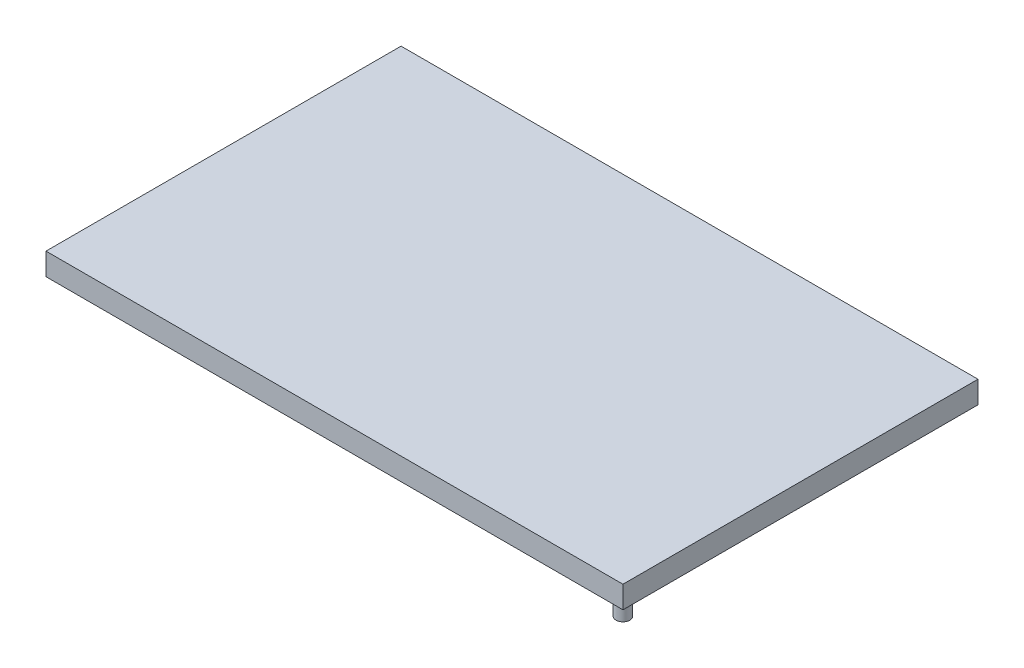
ISO-10303-21;
HEADER;
FILE_DESCRIPTION(('STEP AP214'),'2;1');
FILE_NAME('part.step','',(''),(''),'','','');
FILE_SCHEMA(('AUTOMOTIVE_DESIGN { 1 0 10303 214 1 1 1 1 }'));
ENDSEC;
DATA;
#1=APPLICATION_CONTEXT('core data for automotive mechanical design processes');
#2=APPLICATION_PROTOCOL_DEFINITION('international standard','automotive_design',2000,#1);
#3=PRODUCT_CONTEXT('',#1,'mechanical');
#4=PRODUCT('Part','Part','',(#3));
#5=PRODUCT_RELATED_PRODUCT_CATEGORY('part','',(#4));
#6=PRODUCT_DEFINITION_FORMATION('','',#4);
#7=PRODUCT_DEFINITION_CONTEXT('part definition',#1,'design');
#8=PRODUCT_DEFINITION('design','',#6,#7);
#9=PRODUCT_DEFINITION_SHAPE('','',#8);
#10=(LENGTH_UNIT() NAMED_UNIT(*) SI_UNIT(.MILLI.,.METRE.));
#11=(NAMED_UNIT(*) PLANE_ANGLE_UNIT() SI_UNIT($,.RADIAN.));
#12=(NAMED_UNIT(*) SI_UNIT($,.STERADIAN.) SOLID_ANGLE_UNIT());
#13=UNCERTAINTY_MEASURE_WITH_UNIT(LENGTH_MEASURE(1.E-05),#10,'distance_accuracy_value','');
#14=(GEOMETRIC_REPRESENTATION_CONTEXT(3) GLOBAL_UNCERTAINTY_ASSIGNED_CONTEXT((#13)) GLOBAL_UNIT_ASSIGNED_CONTEXT((#10,
#11,#12)) REPRESENTATION_CONTEXT('',''));
#15=CARTESIAN_POINT('',(0.,0.,0.));
#16=DIRECTION('',(0.,0.,1.));
#17=DIRECTION('',(1.,0.,0.));
#18=AXIS2_PLACEMENT_3D('',#15,#16,#17);
#19=CARTESIAN_POINT('',(-104.,8.,-64.));
#20=DIRECTION('',(0.,0.,-1.));
#21=DIRECTION('',(-1.,0.,0.));
#22=AXIS2_PLACEMENT_3D('',#19,#20,#21);
#23=PLANE('',#22);
#24=DIRECTION('',(1.,0.,0.));
#25=VECTOR('',#24,1.);
#26=CARTESIAN_POINT('',(-104.,0.,-64.));
#27=LINE('',#26,#25);
#28=CARTESIAN_POINT('',(-104.,0.,-64.));
#29=VERTEX_POINT('',#28);
#30=CARTESIAN_POINT('',(104.,0.,-64.));
#31=VERTEX_POINT('',#30);
#32=EDGE_CURVE('E112',#29,#31,#27,.T.);
#33=ORIENTED_EDGE('',*,*,#32,.F.);
#34=DIRECTION('',(0.,-1.,0.));
#35=VECTOR('',#34,1.);
#36=CARTESIAN_POINT('',(-104.,8.,-64.));
#37=LINE('',#36,#35);
#38=CARTESIAN_POINT('',(-104.,8.,-64.));
#39=VERTEX_POINT('',#38);
#40=EDGE_CURVE('E55',#39,#29,#37,.T.);
#41=ORIENTED_EDGE('',*,*,#40,.F.);
#42=DIRECTION('',(1.,0.,0.));
#43=VECTOR('',#42,1.);
#44=CARTESIAN_POINT('',(-104.,8.,-64.));
#45=LINE('',#44,#43);
#46=CARTESIAN_POINT('',(104.,8.,-64.));
#47=VERTEX_POINT('',#46);
#48=EDGE_CURVE('E144',#39,#47,#45,.T.);
#49=ORIENTED_EDGE('',*,*,#48,.T.);
#50=DIRECTION('',(0.,-1.,0.));
#51=VECTOR('',#50,1.);
#52=CARTESIAN_POINT('',(104.,8.,-64.));
#53=LINE('',#52,#51);
#54=EDGE_CURVE('E80',#47,#31,#53,.T.);
#55=ORIENTED_EDGE('',*,*,#54,.T.);
#56=EDGE_LOOP('',(#33,#41,#49,#55));
#57=FACE_BOUND('',#56,.T.);
#58=ADVANCED_FACE('F32',(#57),#23,.T.);
#59=CARTESIAN_POINT('',(-104.,8.,-64.));
#60=DIRECTION('',(1.,0.,0.));
#61=DIRECTION('',(0.,0.,-1.));
#62=AXIS2_PLACEMENT_3D('',#59,#60,#61);
#63=PLANE('',#62);
#64=DIRECTION('',(0.,0.,1.));
#65=VECTOR('',#64,1.);
#66=CARTESIAN_POINT('',(-104.,0.,-64.));
#67=LINE('',#66,#65);
#68=CARTESIAN_POINT('',(-104.,0.,64.));
#69=VERTEX_POINT('',#68);
#70=EDGE_CURVE('E147',#29,#69,#67,.T.);
#71=ORIENTED_EDGE('',*,*,#70,.T.);
#72=DIRECTION('',(0.,-1.,0.));
#73=VECTOR('',#72,1.);
#74=CARTESIAN_POINT('',(-104.,8.,64.));
#75=LINE('',#74,#73);
#76=CARTESIAN_POINT('',(-104.,8.,64.));
#77=VERTEX_POINT('',#76);
#78=EDGE_CURVE('E163',#77,#69,#75,.T.);
#79=ORIENTED_EDGE('',*,*,#78,.F.);
#80=DIRECTION('',(0.,0.,1.));
#81=VECTOR('',#80,1.);
#82=CARTESIAN_POINT('',(-104.,8.,-64.));
#83=LINE('',#82,#81);
#84=EDGE_CURVE('E151',#39,#77,#83,.T.);
#85=ORIENTED_EDGE('',*,*,#84,.F.);
#86=ORIENTED_EDGE('',*,*,#40,.T.);
#87=EDGE_LOOP('',(#71,#79,#85,#86));
#88=FACE_BOUND('',#87,.T.);
#89=ADVANCED_FACE('F189',(#88),#63,.F.);
#90=CARTESIAN_POINT('',(-104.,8.,64.));
#91=DIRECTION('',(0.,0.,-1.));
#92=DIRECTION('',(-1.,0.,0.));
#93=AXIS2_PLACEMENT_3D('',#90,#91,#92);
#94=PLANE('',#93);
#95=DIRECTION('',(1.,0.,0.));
#96=VECTOR('',#95,1.);
#97=CARTESIAN_POINT('',(-104.,0.,64.));
#98=LINE('',#97,#96);
#99=CARTESIAN_POINT('',(104.,0.,64.));
#100=VERTEX_POINT('',#99);
#101=EDGE_CURVE('E158',#69,#100,#98,.T.);
#102=ORIENTED_EDGE('',*,*,#101,.T.);
#103=DIRECTION('',(0.,-1.,0.));
#104=VECTOR('',#103,1.);
#105=CARTESIAN_POINT('',(104.,8.,64.));
#106=LINE('',#105,#104);
#107=CARTESIAN_POINT('',(104.,8.,64.));
#108=VERTEX_POINT('',#107);
#109=EDGE_CURVE('E166',#108,#100,#106,.T.);
#110=ORIENTED_EDGE('',*,*,#109,.F.);
#111=DIRECTION('',(1.,0.,0.));
#112=VECTOR('',#111,1.);
#113=CARTESIAN_POINT('',(-104.,8.,64.));
#114=LINE('',#113,#112);
#115=EDGE_CURVE('E149',#77,#108,#114,.T.);
#116=ORIENTED_EDGE('',*,*,#115,.F.);
#117=ORIENTED_EDGE('',*,*,#78,.T.);
#118=EDGE_LOOP('',(#102,#110,#116,#117));
#119=FACE_BOUND('',#118,.T.);
#120=ADVANCED_FACE('F193',(#119),#94,.F.);
#121=CARTESIAN_POINT('',(104.,8.,-64.));
#122=DIRECTION('',(1.,0.,0.));
#123=DIRECTION('',(0.,0.,-1.));
#124=AXIS2_PLACEMENT_3D('',#121,#122,#123);
#125=PLANE('',#124);
#126=DIRECTION('',(0.,0.,1.));
#127=VECTOR('',#126,1.);
#128=CARTESIAN_POINT('',(104.,0.,-64.));
#129=LINE('',#128,#127);
#130=EDGE_CURVE('E155',#31,#100,#129,.T.);
#131=ORIENTED_EDGE('',*,*,#130,.F.);
#132=ORIENTED_EDGE('',*,*,#54,.F.);
#133=DIRECTION('',(0.,0.,1.));
#134=VECTOR('',#133,1.);
#135=CARTESIAN_POINT('',(104.,8.,-64.));
#136=LINE('',#135,#134);
#137=EDGE_CURVE('E146',#47,#108,#136,.T.);
#138=ORIENTED_EDGE('',*,*,#137,.T.);
#139=ORIENTED_EDGE('',*,*,#109,.T.);
#140=EDGE_LOOP('',(#131,#132,#138,#139));
#141=FACE_BOUND('',#140,.T.);
#142=ADVANCED_FACE('F205',(#141),#125,.T.);
#143=CARTESIAN_POINT('',(0.,8.,0.));
#144=DIRECTION('',(0.,-1.,0.));
#145=DIRECTION('',(0.,0.,-1.));
#146=AXIS2_PLACEMENT_3D('',#143,#144,#145);
#147=PLANE('',#146);
#148=ORIENTED_EDGE('',*,*,#48,.F.);
#149=ORIENTED_EDGE('',*,*,#84,.T.);
#150=ORIENTED_EDGE('',*,*,#115,.T.);
#151=ORIENTED_EDGE('',*,*,#137,.F.);
#152=EDGE_LOOP('',(#148,#149,#150,#151));
#153=FACE_BOUND('',#152,.T.);
#154=ADVANCED_FACE('F204',(#153),#147,.F.);
#155=CARTESIAN_POINT('',(0.,0.,0.));
#156=DIRECTION('',(0.,-1.,0.));
#157=DIRECTION('',(0.,0.,-1.));
#158=AXIS2_PLACEMENT_3D('',#155,#156,#157);
#159=PLANE('',#158);
#160=DIRECTION('',(0.,0.,1.));
#161=VECTOR('',#160,1.);
#162=CARTESIAN_POINT('',(100.,0.,0.));
#163=LINE('',#162,#161);
#164=CARTESIAN_POINT('',(100.,0.,-60.));
#165=VERTEX_POINT('',#164);
#166=CARTESIAN_POINT('',(100.,0.,60.));
#167=VERTEX_POINT('',#166);
#168=EDGE_CURVE('E46',#165,#167,#163,.T.);
#169=ORIENTED_EDGE('',*,*,#168,.F.);
#170=DIRECTION('',(1.,0.,0.));
#171=VECTOR('',#170,1.);
#172=CARTESIAN_POINT('',(0.,0.,-60.));
#173=LINE('',#172,#171);
#174=CARTESIAN_POINT('',(-100.,0.,-60.));
#175=VERTEX_POINT('',#174);
#176=EDGE_CURVE('E111',#175,#165,#173,.T.);
#177=ORIENTED_EDGE('',*,*,#176,.F.);
#178=DIRECTION('',(0.,0.,1.));
#179=VECTOR('',#178,1.);
#180=CARTESIAN_POINT('',(-100.,0.,0.));
#181=LINE('',#180,#179);
#182=CARTESIAN_POINT('',(-100.,0.,60.));
#183=VERTEX_POINT('',#182);
#184=EDGE_CURVE('E135',#175,#183,#181,.T.);
#185=ORIENTED_EDGE('',*,*,#184,.T.);
#186=DIRECTION('',(1.,0.,0.));
#187=VECTOR('',#186,1.);
#188=CARTESIAN_POINT('',(0.,0.,60.));
#189=LINE('',#188,#187);
#190=EDGE_CURVE('E121',#183,#167,#189,.T.);
#191=ORIENTED_EDGE('',*,*,#190,.T.);
#192=EDGE_LOOP('',(#169,#177,#185,#191));
#193=FACE_BOUND('',#192,.T.);
#194=ORIENTED_EDGE('',*,*,#32,.T.);
#195=ORIENTED_EDGE('',*,*,#130,.T.);
#196=ORIENTED_EDGE('',*,*,#101,.F.);
#197=ORIENTED_EDGE('',*,*,#70,.F.);
#198=EDGE_LOOP('',(#194,#195,#196,#197));
#199=FACE_BOUND('',#198,.T.);
#200=ADVANCED_FACE('F196',(#193,#199),#159,.T.);
#201=CARTESIAN_POINT('',(100.,4.,0.));
#202=DIRECTION('',(1.,0.,0.));
#203=DIRECTION('',(0.,0.,-1.));
#204=AXIS2_PLACEMENT_3D('',#201,#202,#203);
#205=PLANE('',#204);
#206=ORIENTED_EDGE('',*,*,#168,.T.);
#207=DIRECTION('',(0.,-1.,0.));
#208=VECTOR('',#207,1.);
#209=CARTESIAN_POINT('',(100.,4.,60.));
#210=LINE('',#209,#208);
#211=CARTESIAN_POINT('',(100.,4.,60.));
#212=VERTEX_POINT('',#211);
#213=EDGE_CURVE('E118',#212,#167,#210,.T.);
#214=ORIENTED_EDGE('',*,*,#213,.F.);
#215=DIRECTION('',(0.,0.,1.));
#216=VECTOR('',#215,1.);
#217=CARTESIAN_POINT('',(100.,4.,0.));
#218=LINE('',#217,#216);
#219=CARTESIAN_POINT('',(100.,4.,-60.));
#220=VERTEX_POINT('',#219);
#221=EDGE_CURVE('E116',#220,#212,#218,.T.);
#222=ORIENTED_EDGE('',*,*,#221,.F.);
#223=DIRECTION('',(0.,-1.,0.));
#224=VECTOR('',#223,1.);
#225=CARTESIAN_POINT('',(100.,4.,-60.));
#226=LINE('',#225,#224);
#227=EDGE_CURVE('E105',#220,#165,#226,.T.);
#228=ORIENTED_EDGE('',*,*,#227,.T.);
#229=EDGE_LOOP('',(#206,#214,#222,#228));
#230=FACE_BOUND('',#229,.T.);
#231=ADVANCED_FACE('F117',(#230),#205,.F.);
#232=CARTESIAN_POINT('',(0.,4.,-60.));
#233=DIRECTION('',(0.,0.,-1.));
#234=DIRECTION('',(-1.,0.,0.));
#235=AXIS2_PLACEMENT_3D('',#232,#233,#234);
#236=PLANE('',#235);
#237=ORIENTED_EDGE('',*,*,#176,.T.);
#238=ORIENTED_EDGE('',*,*,#227,.F.);
#239=DIRECTION('',(1.,0.,0.));
#240=VECTOR('',#239,1.);
#241=CARTESIAN_POINT('',(0.,4.,-60.));
#242=LINE('',#241,#240);
#243=CARTESIAN_POINT('',(-100.,4.,-60.));
#244=VERTEX_POINT('',#243);
#245=EDGE_CURVE('E109',#244,#220,#242,.T.);
#246=ORIENTED_EDGE('',*,*,#245,.F.);
#247=DIRECTION('',(0.,-1.,0.));
#248=VECTOR('',#247,1.);
#249=CARTESIAN_POINT('',(-100.,4.,-60.));
#250=LINE('',#249,#248);
#251=EDGE_CURVE('E113',#244,#175,#250,.T.);
#252=ORIENTED_EDGE('',*,*,#251,.T.);
#253=EDGE_LOOP('',(#237,#238,#246,#252));
#254=FACE_BOUND('',#253,.T.);
#255=ADVANCED_FACE('F107',(#254),#236,.F.);
#256=CARTESIAN_POINT('',(-100.,4.,0.));
#257=DIRECTION('',(1.,0.,0.));
#258=DIRECTION('',(0.,0.,-1.));
#259=AXIS2_PLACEMENT_3D('',#256,#257,#258);
#260=PLANE('',#259);
#261=ORIENTED_EDGE('',*,*,#184,.F.);
#262=ORIENTED_EDGE('',*,*,#251,.F.);
#263=DIRECTION('',(0.,0.,1.));
#264=VECTOR('',#263,1.);
#265=CARTESIAN_POINT('',(-100.,4.,0.));
#266=LINE('',#265,#264);
#267=CARTESIAN_POINT('',(-100.,4.,60.));
#268=VERTEX_POINT('',#267);
#269=EDGE_CURVE('E125',#244,#268,#266,.T.);
#270=ORIENTED_EDGE('',*,*,#269,.T.);
#271=DIRECTION('',(0.,-1.,0.));
#272=VECTOR('',#271,1.);
#273=CARTESIAN_POINT('',(-100.,4.,60.));
#274=LINE('',#273,#272);
#275=EDGE_CURVE('E141',#268,#183,#274,.T.);
#276=ORIENTED_EDGE('',*,*,#275,.T.);
#277=EDGE_LOOP('',(#261,#262,#270,#276));
#278=FACE_BOUND('',#277,.T.);
#279=ADVANCED_FACE('F184',(#278),#260,.T.);
#280=CARTESIAN_POINT('',(0.,4.,60.));
#281=DIRECTION('',(0.,0.,-1.));
#282=DIRECTION('',(-1.,0.,0.));
#283=AXIS2_PLACEMENT_3D('',#280,#281,#282);
#284=PLANE('',#283);
#285=ORIENTED_EDGE('',*,*,#190,.F.);
#286=ORIENTED_EDGE('',*,*,#275,.F.);
#287=DIRECTION('',(1.,0.,0.));
#288=VECTOR('',#287,1.);
#289=CARTESIAN_POINT('',(0.,4.,60.));
#290=LINE('',#289,#288);
#291=EDGE_CURVE('E127',#268,#212,#290,.T.);
#292=ORIENTED_EDGE('',*,*,#291,.T.);
#293=ORIENTED_EDGE('',*,*,#213,.T.);
#294=EDGE_LOOP('',(#285,#286,#292,#293));
#295=FACE_BOUND('',#294,.T.);
#296=ADVANCED_FACE('F174',(#295),#284,.T.);
#297=CARTESIAN_POINT('',(0.,4.,0.));
#298=DIRECTION('',(0.,1.,0.));
#299=DIRECTION('',(0.,0.,1.));
#300=AXIS2_PLACEMENT_3D('',#297,#298,#299);
#301=PLANE('',#300);
#302=CARTESIAN_POINT('',(90.,4.,50.));
#303=DIRECTION('',(0.,1.,0.));
#304=DIRECTION('',(0.,0.,1.));
#305=AXIS2_PLACEMENT_3D('',#302,#303,#304);
#306=CIRCLE('',#305,2.50000000000001);
#307=CARTESIAN_POINT('',(90.,4.,52.5));
#308=VERTEX_POINT('',#307);
#309=EDGE_CURVE('E11',#308,#308,#306,.F.);
#310=ORIENTED_EDGE('',*,*,#309,.F.);
#311=EDGE_LOOP('',(#310));
#312=FACE_BOUND('',#311,.T.);
#313=CARTESIAN_POINT('',(-90.,4.,-50.));
#314=DIRECTION('',(0.,1.,0.));
#315=DIRECTION('',(0.,0.,1.));
#316=AXIS2_PLACEMENT_3D('',#313,#314,#315);
#317=CIRCLE('',#316,2.50000000000001);
#318=CARTESIAN_POINT('',(-90.,4.,-47.5));
#319=VERTEX_POINT('',#318);
#320=EDGE_CURVE('E39',#319,#319,#317,.F.);
#321=ORIENTED_EDGE('',*,*,#320,.F.);
#322=EDGE_LOOP('',(#321));
#323=FACE_BOUND('',#322,.T.);
#324=ORIENTED_EDGE('',*,*,#221,.T.);
#325=ORIENTED_EDGE('',*,*,#291,.F.);
#326=ORIENTED_EDGE('',*,*,#269,.F.);
#327=ORIENTED_EDGE('',*,*,#245,.T.);
#328=EDGE_LOOP('',(#324,#325,#326,#327));
#329=FACE_BOUND('',#328,.T.);
#330=ADVANCED_FACE('F124',(#312,#323,#329),#301,.F.);
#331=CARTESIAN_POINT('',(-90.,-16.,-50.));
#332=DIRECTION('',(0.,1.,0.));
#333=DIRECTION('',(0.,0.,1.));
#334=AXIS2_PLACEMENT_3D('',#331,#332,#333);
#335=CYLINDRICAL_SURFACE('',#334,2.50000000000001);
#336=CARTESIAN_POINT('',(-90.,-16.,-50.));
#337=DIRECTION('',(0.,-1.,0.));
#338=DIRECTION('',(0.,0.,-1.));
#339=AXIS2_PLACEMENT_3D('',#336,#337,#338);
#340=CIRCLE('',#339,2.50000000000001);
#341=CARTESIAN_POINT('',(-90.,-16.,-52.5));
#342=VERTEX_POINT('',#341);
#343=EDGE_CURVE('E133',#342,#342,#340,.T.);
#344=ORIENTED_EDGE('',*,*,#343,.F.);
#345=EDGE_LOOP('',(#344));
#346=FACE_BOUND('',#345,.T.);
#347=ORIENTED_EDGE('',*,*,#320,.T.);
#348=EDGE_LOOP('',(#347));
#349=FACE_BOUND('',#348,.T.);
#350=ADVANCED_FACE('F171',(#346,#349),#335,.T.);
#351=CARTESIAN_POINT('',(-90.,-16.,-50.));
#352=DIRECTION('',(0.,-1.,0.));
#353=DIRECTION('',(0.,0.,-1.));
#354=AXIS2_PLACEMENT_3D('',#351,#352,#353);
#355=PLANE('',#354);
#356=ORIENTED_EDGE('',*,*,#343,.T.);
#357=EDGE_LOOP('',(#356));
#358=FACE_BOUND('',#357,.T.);
#359=ADVANCED_FACE('F181',(#358),#355,.T.);
#360=CARTESIAN_POINT('',(90.,-16.,50.));
#361=DIRECTION('',(0.,1.,0.));
#362=DIRECTION('',(0.,0.,1.));
#363=AXIS2_PLACEMENT_3D('',#360,#361,#362);
#364=CYLINDRICAL_SURFACE('',#363,2.50000000000001);
#365=CARTESIAN_POINT('',(90.,-16.,50.));
#366=DIRECTION('',(0.,-1.,0.));
#367=DIRECTION('',(0.,0.,-1.));
#368=AXIS2_PLACEMENT_3D('',#365,#366,#367);
#369=CIRCLE('',#368,2.50000000000001);
#370=CARTESIAN_POINT('',(90.,-16.,47.5));
#371=VERTEX_POINT('',#370);
#372=EDGE_CURVE('E279',#371,#371,#369,.T.);
#373=ORIENTED_EDGE('',*,*,#372,.F.);
#374=EDGE_LOOP('',(#373));
#375=FACE_BOUND('',#374,.T.);
#376=ORIENTED_EDGE('',*,*,#309,.T.);
#377=EDGE_LOOP('',(#376));
#378=FACE_BOUND('',#377,.T.);
#379=ADVANCED_FACE('F253',(#375,#378),#364,.T.);
#380=CARTESIAN_POINT('',(90.,-16.,50.));
#381=DIRECTION('',(0.,-1.,0.));
#382=DIRECTION('',(0.,0.,-1.));
#383=AXIS2_PLACEMENT_3D('',#380,#381,#382);
#384=PLANE('',#383);
#385=ORIENTED_EDGE('',*,*,#372,.T.);
#386=EDGE_LOOP('',(#385));
#387=FACE_BOUND('',#386,.T.);
#388=ADVANCED_FACE('F263',(#387),#384,.T.);
#389=CLOSED_SHELL('',(#58,#89,#120,#142,#154,#200,#231,#255,#279,#296,#330,#350,#359,#379,#388));
#390=MANIFOLD_SOLID_BREP('B2',#389);
#391=ADVANCED_BREP_SHAPE_REPRESENTATION('',(#18,#390),#14);
#392=SHAPE_DEFINITION_REPRESENTATION(#9,#391);
ENDSEC;
END-ISO-10303-21;
